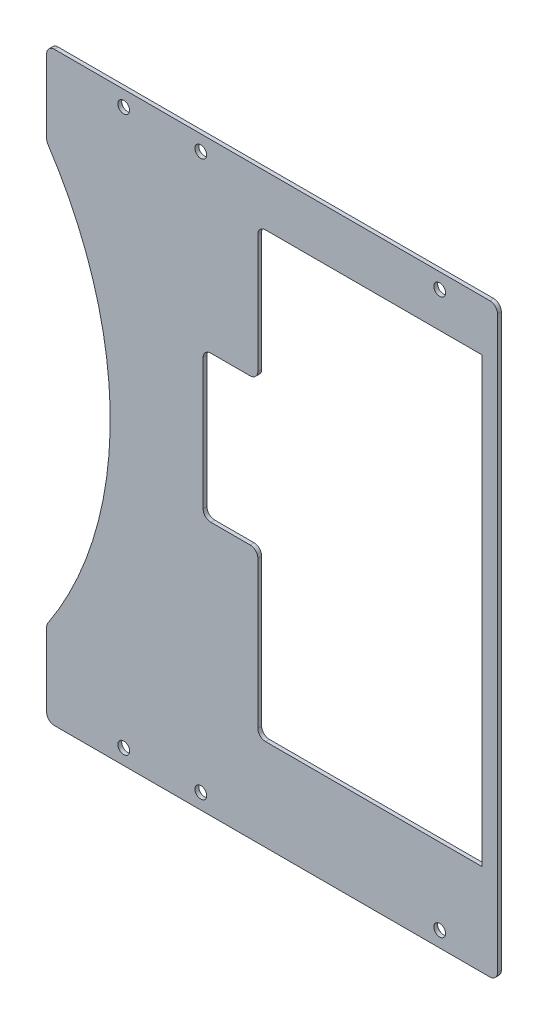
ISO-10303-21;
HEADER;
FILE_DESCRIPTION(('STEP AP214'),'2;1');
FILE_NAME('part.step','',(''),(''),'','','');
FILE_SCHEMA(('AUTOMOTIVE_DESIGN { 1 0 10303 214 1 1 1 1 }'));
ENDSEC;
DATA;
#1=APPLICATION_CONTEXT('core data for automotive mechanical design processes');
#2=APPLICATION_PROTOCOL_DEFINITION('international standard','automotive_design',2000,#1);
#3=PRODUCT_CONTEXT('',#1,'mechanical');
#4=PRODUCT('Part','Part','',(#3));
#5=PRODUCT_RELATED_PRODUCT_CATEGORY('part','',(#4));
#6=PRODUCT_DEFINITION_FORMATION('','',#4);
#7=PRODUCT_DEFINITION_CONTEXT('part definition',#1,'design');
#8=PRODUCT_DEFINITION('design','',#6,#7);
#9=PRODUCT_DEFINITION_SHAPE('','',#8);
#10=(LENGTH_UNIT() NAMED_UNIT(*) SI_UNIT(.MILLI.,.METRE.));
#11=(NAMED_UNIT(*) PLANE_ANGLE_UNIT() SI_UNIT($,.RADIAN.));
#12=(NAMED_UNIT(*) SI_UNIT($,.STERADIAN.) SOLID_ANGLE_UNIT());
#13=UNCERTAINTY_MEASURE_WITH_UNIT(LENGTH_MEASURE(1.E-05),#10,'distance_accuracy_value','');
#14=(GEOMETRIC_REPRESENTATION_CONTEXT(3) GLOBAL_UNCERTAINTY_ASSIGNED_CONTEXT((#13)) GLOBAL_UNIT_ASSIGNED_CONTEXT((#10,
#11,#12)) REPRESENTATION_CONTEXT('',''));
#15=CARTESIAN_POINT('',(0.,0.,0.));
#16=DIRECTION('',(0.,0.,1.));
#17=DIRECTION('',(1.,0.,0.));
#18=AXIS2_PLACEMENT_3D('',#15,#16,#17);
#19=CARTESIAN_POINT('',(34.7980389908,62.8000005715852,10.));
#20=DIRECTION('',(-1.,0.,0.));
#21=DIRECTION('',(0.,-1.,0.));
#22=AXIS2_PLACEMENT_3D('',#19,#20,#21);
#23=PLANE('',#22);
#24=DIRECTION('',(0.,1.,0.));
#25=VECTOR('',#24,1.);
#26=CARTESIAN_POINT('',(34.7980389908,62.8000005715852,0.));
#27=LINE('',#26,#25);
#28=CARTESIAN_POINT('',(34.7980389908,29.9999931858932,0.));
#29=VERTEX_POINT('',#28);
#30=CARTESIAN_POINT('',(34.7980389908,60.8000005715852,0.));
#31=VERTEX_POINT('',#30);
#32=EDGE_CURVE('E251',#29,#31,#27,.T.);
#33=ORIENTED_EDGE('',*,*,#32,.T.);
#34=DIRECTION('',(0.,0.,-1.));
#35=VECTOR('',#34,1.);
#36=CARTESIAN_POINT('',(34.7980389908,60.8000005715852,0.999999999999999));
#37=LINE('',#36,#35);
#38=CARTESIAN_POINT('',(34.7980389908,60.8000005715852,1.));
#39=VERTEX_POINT('',#38);
#40=EDGE_CURVE('E418',#31,#39,#37,.F.);
#41=ORIENTED_EDGE('',*,*,#40,.T.);
#42=DIRECTION('',(0.,-1.,0.));
#43=VECTOR('',#42,1.);
#44=CARTESIAN_POINT('',(34.7980389908,0.,1.));
#45=LINE('',#44,#43);
#46=CARTESIAN_POINT('',(34.7980389908,29.9999931858932,1.));
#47=VERTEX_POINT('',#46);
#48=EDGE_CURVE('E265',#39,#47,#45,.T.);
#49=ORIENTED_EDGE('',*,*,#48,.T.);
#50=DIRECTION('',(0.,0.,-1.));
#51=VECTOR('',#50,1.);
#52=CARTESIAN_POINT('',(34.7980389908,29.9999931858932,10.));
#53=LINE('',#52,#51);
#54=EDGE_CURVE('E415',#47,#29,#53,.T.);
#55=ORIENTED_EDGE('',*,*,#54,.T.);
#56=EDGE_LOOP('',(#33,#41,#49,#55));
#57=FACE_BOUND('',#56,.T.);
#58=ADVANCED_FACE('F35',(#57),#23,.F.);
#59=CARTESIAN_POINT('',(-20.,-76.,1.));
#60=DIRECTION('',(1.,0.,0.));
#61=DIRECTION('',(0.,0.,-1.));
#62=AXIS2_PLACEMENT_3D('',#59,#60,#61);
#63=PLANE('',#62);
#64=DIRECTION('',(0.,-1.,0.));
#65=VECTOR('',#64,1.);
#66=CARTESIAN_POINT('',(-20.,-76.,0.));
#67=LINE('',#66,#65);
#68=CARTESIAN_POINT('',(-20.,-54.8748576307953,0.));
#69=VERTEX_POINT('',#68);
#70=CARTESIAN_POINT('',(-20.,-74.,0.));
#71=VERTEX_POINT('',#70);
#72=EDGE_CURVE('E302',#69,#71,#67,.T.);
#73=ORIENTED_EDGE('',*,*,#72,.T.);
#74=DIRECTION('',(0.,0.,-1.));
#75=VECTOR('',#74,1.);
#76=CARTESIAN_POINT('',(-20.,-74.,1.));
#77=LINE('',#76,#75);
#78=CARTESIAN_POINT('',(-20.,-74.,1.));
#79=VERTEX_POINT('',#78);
#80=EDGE_CURVE('E396',#71,#79,#77,.F.);
#81=ORIENTED_EDGE('',*,*,#80,.T.);
#82=DIRECTION('',(0.,-1.,0.));
#83=VECTOR('',#82,1.);
#84=CARTESIAN_POINT('',(-20.,-76.,1.));
#85=LINE('',#84,#83);
#86=CARTESIAN_POINT('',(-20.,-54.8748576307953,1.));
#87=VERTEX_POINT('',#86);
#88=EDGE_CURVE('E305',#87,#79,#85,.T.);
#89=ORIENTED_EDGE('',*,*,#88,.F.);
#90=DIRECTION('',(0.,0.,-1.));
#91=VECTOR('',#90,1.);
#92=CARTESIAN_POINT('',(-20.,-54.8748576307953,1.));
#93=LINE('',#92,#91);
#94=EDGE_CURVE('E393',#87,#69,#93,.T.);
#95=ORIENTED_EDGE('',*,*,#94,.T.);
#96=EDGE_LOOP('',(#73,#81,#89,#95));
#97=FACE_BOUND('',#96,.T.);
#98=ADVANCED_FACE('F497',(#97),#63,.F.);
#99=CARTESIAN_POINT('',(0.,0.,1.));
#100=DIRECTION('',(0.,0.,1.));
#101=DIRECTION('',(1.,0.,0.));
#102=AXIS2_PLACEMENT_3D('',#99,#100,#101);
#103=PLANE('',#102);
#104=CARTESIAN_POINT('',(95.,-74.,1.));
#105=DIRECTION('',(0.,0.,1.));
#106=DIRECTION('',(1.,0.,0.));
#107=AXIS2_PLACEMENT_3D('',#104,#105,#106);
#108=CIRCLE('',#107,2.);
#109=CARTESIAN_POINT('',(95.,-76.,1.));
#110=VERTEX_POINT('',#109);
#111=CARTESIAN_POINT('',(97.,-74.,1.));
#112=VERTEX_POINT('',#111);
#113=EDGE_CURVE('E362',#110,#112,#108,.T.);
#114=ORIENTED_EDGE('',*,*,#113,.T.);
#115=DIRECTION('',(0.,1.,0.));
#116=VECTOR('',#115,1.);
#117=CARTESIAN_POINT('',(97.,-76.,1.));
#118=LINE('',#117,#116);
#119=CARTESIAN_POINT('',(97.,74.,1.));
#120=VERTEX_POINT('',#119);
#121=EDGE_CURVE('E313',#112,#120,#118,.T.);
#122=ORIENTED_EDGE('',*,*,#121,.T.);
#123=CARTESIAN_POINT('',(95.,74.,1.));
#124=DIRECTION('',(0.,0.,1.));
#125=DIRECTION('',(1.,0.,0.));
#126=AXIS2_PLACEMENT_3D('',#123,#124,#125);
#127=CIRCLE('',#126,2.);
#128=CARTESIAN_POINT('',(95.,76.,1.));
#129=VERTEX_POINT('',#128);
#130=EDGE_CURVE('E350',#120,#129,#127,.T.);
#131=ORIENTED_EDGE('',*,*,#130,.T.);
#132=DIRECTION('',(-1.,0.,0.));
#133=VECTOR('',#132,1.);
#134=CARTESIAN_POINT('',(97.,76.,1.));
#135=LINE('',#134,#133);
#136=CARTESIAN_POINT('',(-18.,76.,1.));
#137=VERTEX_POINT('',#136);
#138=EDGE_CURVE('E316',#129,#137,#135,.T.);
#139=ORIENTED_EDGE('',*,*,#138,.T.);
#140=CARTESIAN_POINT('',(-18.,74.,1.));
#141=DIRECTION('',(0.,0.,1.));
#142=DIRECTION('',(1.,0.,0.));
#143=AXIS2_PLACEMENT_3D('',#140,#141,#142);
#144=CIRCLE('',#143,2.);
#145=CARTESIAN_POINT('',(-20.,74.,1.));
#146=VERTEX_POINT('',#145);
#147=EDGE_CURVE('E354',#137,#146,#144,.T.);
#148=ORIENTED_EDGE('',*,*,#147,.T.);
#149=CARTESIAN_POINT('',(-20.,54.874857630795,1.));
#150=VERTEX_POINT('',#149);
#151=EDGE_CURVE('E308',#146,#150,#85,.T.);
#152=ORIENTED_EDGE('',*,*,#151,.T.);
#153=CARTESIAN_POINT('',(-18.,54.874857630795,0.999999999999999));
#154=DIRECTION('',(0.,0.,1.));
#155=DIRECTION('',(1.,0.,0.));
#156=AXIS2_PLACEMENT_3D('',#153,#154,#155);
#157=CIRCLE('',#156,2.);
#158=CARTESIAN_POINT('',(-19.6683417085427,53.7718454171107,0.999999999999999));
#159=VERTEX_POINT('',#158);
#160=EDGE_CURVE('E356',#150,#159,#157,.T.);
#161=ORIENTED_EDGE('',*,*,#160,.T.);
#162=CARTESIAN_POINT('',(-101.,-1.2490009027033E-13,0.999999999999999));
#163=DIRECTION('',(0.,0.,1.));
#164=DIRECTION('',(1.,0.,0.));
#165=AXIS2_PLACEMENT_3D('',#162,#163,#164);
#166=CIRCLE('',#165,97.5);
#167=CARTESIAN_POINT('',(-19.6683417085427,-53.7718454171109,0.999999999999999));
#168=VERTEX_POINT('',#167);
#169=EDGE_CURVE('E261',#168,#159,#166,.T.);
#170=ORIENTED_EDGE('',*,*,#169,.F.);
#171=CARTESIAN_POINT('',(-18.,-54.8748576307953,0.999999999999999));
#172=DIRECTION('',(0.,0.,1.));
#173=DIRECTION('',(1.,0.,0.));
#174=AXIS2_PLACEMENT_3D('',#171,#172,#173);
#175=CIRCLE('',#174,2.);
#176=EDGE_CURVE('E358',#168,#87,#175,.T.);
#177=ORIENTED_EDGE('',*,*,#176,.T.);
#178=ORIENTED_EDGE('',*,*,#88,.T.);
#179=CARTESIAN_POINT('',(-18.,-74.,1.));
#180=DIRECTION('',(0.,0.,1.));
#181=DIRECTION('',(1.,0.,0.));
#182=AXIS2_PLACEMENT_3D('',#179,#180,#181);
#183=CIRCLE('',#182,2.);
#184=CARTESIAN_POINT('',(-18.,-76.,1.));
#185=VERTEX_POINT('',#184);
#186=EDGE_CURVE('E360',#79,#185,#183,.T.);
#187=ORIENTED_EDGE('',*,*,#186,.T.);
#188=DIRECTION('',(1.,0.,0.));
#189=VECTOR('',#188,1.);
#190=CARTESIAN_POINT('',(97.,-76.,1.));
#191=LINE('',#190,#189);
#192=EDGE_CURVE('E310',#185,#110,#191,.T.);
#193=ORIENTED_EDGE('',*,*,#192,.T.);
#194=EDGE_LOOP('',(#114,#122,#131,#139,#148,#152,#161,#170,#177,#178,#187,#193));
#195=FACE_BOUND('',#194,.T.);
#196=CARTESIAN_POINT('',(34.7980389908,-12.0000000000014,1.));
#197=VERTEX_POINT('',#196);
#198=CARTESIAN_POINT('',(34.7980389908,-50.1999994284148,1.));
#199=VERTEX_POINT('',#198);
#200=EDGE_CURVE('E264',#197,#199,#45,.T.);
#201=ORIENTED_EDGE('',*,*,#200,.F.);
#202=CARTESIAN_POINT('',(32.7980389908,-12.0000000000014,0.999999999999999));
#203=DIRECTION('',(0.,0.,1.));
#204=DIRECTION('',(1.,0.,0.));
#205=AXIS2_PLACEMENT_3D('',#202,#203,#204);
#206=CIRCLE('',#205,2.);
#207=CARTESIAN_POINT('',(32.7980389908,-10.0000000000014,1.));
#208=VERTEX_POINT('',#207);
#209=EDGE_CURVE('E365',#197,#208,#206,.T.);
#210=ORIENTED_EDGE('',*,*,#209,.T.);
#211=DIRECTION('',(1.,0.,0.));
#212=VECTOR('',#211,1.);
#213=CARTESIAN_POINT('',(0.,-10.0000000000014,1.));
#214=LINE('',#213,#212);
#215=CARTESIAN_POINT('',(22.5999999999984,-10.0000000000014,1.));
#216=VERTEX_POINT('',#215);
#217=EDGE_CURVE('E242',#216,#208,#214,.T.);
#218=ORIENTED_EDGE('',*,*,#217,.F.);
#219=CARTESIAN_POINT('',(22.5999999999984,-8.00000000000138,0.999999999999999));
#220=DIRECTION('',(0.,0.,1.));
#221=DIRECTION('',(1.,0.,0.));
#222=AXIS2_PLACEMENT_3D('',#219,#220,#221);
#223=CIRCLE('',#222,2.);
#224=CARTESIAN_POINT('',(20.5999999999984,-8.00000000000138,1.));
#225=VERTEX_POINT('',#224);
#226=EDGE_CURVE('E428',#216,#225,#223,.F.);
#227=ORIENTED_EDGE('',*,*,#226,.T.);
#228=DIRECTION('',(0.,-1.,0.));
#229=VECTOR('',#228,1.);
#230=CARTESIAN_POINT('',(20.5999999999984,0.,1.));
#231=LINE('',#230,#229);
#232=CARTESIAN_POINT('',(20.5999999999984,25.9999931858932,1.));
#233=VERTEX_POINT('',#232);
#234=EDGE_CURVE('E248',#233,#225,#231,.T.);
#235=ORIENTED_EDGE('',*,*,#234,.F.);
#236=CARTESIAN_POINT('',(22.5999999999984,25.9999931858932,0.999999999999999));
#237=DIRECTION('',(0.,0.,1.));
#238=DIRECTION('',(1.,0.,0.));
#239=AXIS2_PLACEMENT_3D('',#236,#237,#238);
#240=CIRCLE('',#239,2.);
#241=CARTESIAN_POINT('',(22.5999999999984,27.9999931858932,1.));
#242=VERTEX_POINT('',#241);
#243=EDGE_CURVE('E424',#233,#242,#240,.F.);
#244=ORIENTED_EDGE('',*,*,#243,.T.);
#245=DIRECTION('',(-1.,0.,0.));
#246=VECTOR('',#245,1.);
#247=CARTESIAN_POINT('',(0.,27.9999931858932,1.));
#248=LINE('',#247,#246);
#249=CARTESIAN_POINT('',(32.7980389908,27.9999931858932,1.));
#250=VERTEX_POINT('',#249);
#251=EDGE_CURVE('E245',#250,#242,#248,.T.);
#252=ORIENTED_EDGE('',*,*,#251,.F.);
#253=CARTESIAN_POINT('',(32.7980389908,29.9999931858932,0.999999999999999));
#254=DIRECTION('',(0.,0.,1.));
#255=DIRECTION('',(1.,0.,0.));
#256=AXIS2_PLACEMENT_3D('',#253,#254,#255);
#257=CIRCLE('',#256,2.);
#258=EDGE_CURVE('E352',#250,#47,#257,.T.);
#259=ORIENTED_EDGE('',*,*,#258,.T.);
#260=ORIENTED_EDGE('',*,*,#48,.F.);
#261=CARTESIAN_POINT('',(36.7980389908,60.8000005715852,0.999999999999999));
#262=DIRECTION('',(0.,0.,1.));
#263=DIRECTION('',(1.,0.,0.));
#264=AXIS2_PLACEMENT_3D('',#261,#262,#263);
#265=CIRCLE('',#264,2.);
#266=CARTESIAN_POINT('',(36.7980389908,62.8000005715852,1.));
#267=VERTEX_POINT('',#266);
#268=EDGE_CURVE('E11',#39,#267,#265,.F.);
#269=ORIENTED_EDGE('',*,*,#268,.T.);
#270=DIRECTION('',(-1.,0.,0.));
#271=VECTOR('',#270,1.);
#272=CARTESIAN_POINT('',(0.,62.8000005715852,1.));
#273=LINE('',#272,#271);
#274=CARTESIAN_POINT('',(93.,62.8000005715852,1.));
#275=VERTEX_POINT('',#274);
#276=EDGE_CURVE('E254',#275,#267,#273,.T.);
#277=ORIENTED_EDGE('',*,*,#276,.F.);
#278=DIRECTION('',(0.,-1.,0.));
#279=VECTOR('',#278,1.);
#280=CARTESIAN_POINT('',(93.,62.8000005715852,1.));
#281=LINE('',#280,#279);
#282=CARTESIAN_POINT('',(93.,-52.1999994284148,1.));
#283=VERTEX_POINT('',#282);
#284=EDGE_CURVE('E226',#275,#283,#281,.T.);
#285=ORIENTED_EDGE('',*,*,#284,.T.);
#286=DIRECTION('',(1.,0.,0.));
#287=VECTOR('',#286,1.);
#288=CARTESIAN_POINT('',(0.,-52.1999994284148,1.));
#289=LINE('',#288,#287);
#290=CARTESIAN_POINT('',(36.7980389908,-52.1999994284148,1.));
#291=VERTEX_POINT('',#290);
#292=EDGE_CURVE('E50',#291,#283,#289,.T.);
#293=ORIENTED_EDGE('',*,*,#292,.F.);
#294=CARTESIAN_POINT('',(36.7980389908,-50.1999994284148,0.999999999999999));
#295=DIRECTION('',(0.,0.,1.));
#296=DIRECTION('',(1.,0.,0.));
#297=AXIS2_PLACEMENT_3D('',#294,#295,#296);
#298=CIRCLE('',#297,2.);
#299=EDGE_CURVE('E431',#291,#199,#298,.F.);
#300=ORIENTED_EDGE('',*,*,#299,.T.);
#301=EDGE_LOOP('',(#201,#210,#218,#227,#235,#244,#252,#259,#260,#269,#277,#285,#293,#300));
#302=FACE_BOUND('',#301,.T.);
#303=CARTESIAN_POINT('',(82.,-72.,1.));
#304=DIRECTION('',(0.,0.,1.));
#305=DIRECTION('',(1.,0.,0.));
#306=AXIS2_PLACEMENT_3D('',#303,#304,#305);
#307=CIRCLE('',#306,1.525);
#308=CARTESIAN_POINT('',(83.525,-72.,1.));
#309=VERTEX_POINT('',#308);
#310=EDGE_CURVE('E275',#309,#309,#307,.T.);
#311=ORIENTED_EDGE('',*,*,#310,.F.);
#312=EDGE_LOOP('',(#311));
#313=FACE_BOUND('',#312,.T.);
#314=CARTESIAN_POINT('',(20.,72.,1.));
#315=DIRECTION('',(0.,0.,1.));
#316=DIRECTION('',(1.,0.,0.));
#317=AXIS2_PLACEMENT_3D('',#314,#315,#316);
#318=CIRCLE('',#317,1.525);
#319=CARTESIAN_POINT('',(21.525,72.,1.));
#320=VERTEX_POINT('',#319);
#321=EDGE_CURVE('E287',#320,#320,#318,.T.);
#322=ORIENTED_EDGE('',*,*,#321,.F.);
#323=EDGE_LOOP('',(#322));
#324=FACE_BOUND('',#323,.T.);
#325=CARTESIAN_POINT('',(0.,72.,1.));
#326=DIRECTION('',(0.,0.,1.));
#327=DIRECTION('',(1.,0.,0.));
#328=AXIS2_PLACEMENT_3D('',#325,#326,#327);
#329=CIRCLE('',#328,1.525);
#330=CARTESIAN_POINT('',(1.525,72.,1.));
#331=VERTEX_POINT('',#330);
#332=EDGE_CURVE('E299',#331,#331,#329,.T.);
#333=ORIENTED_EDGE('',*,*,#332,.F.);
#334=EDGE_LOOP('',(#333));
#335=FACE_BOUND('',#334,.T.);
#336=CARTESIAN_POINT('',(0.,-72.,1.));
#337=DIRECTION('',(0.,0.,1.));
#338=DIRECTION('',(1.,0.,0.));
#339=AXIS2_PLACEMENT_3D('',#336,#337,#338);
#340=CIRCLE('',#339,1.525);
#341=CARTESIAN_POINT('',(1.525,-72.,1.));
#342=VERTEX_POINT('',#341);
#343=EDGE_CURVE('E293',#342,#342,#340,.T.);
#344=ORIENTED_EDGE('',*,*,#343,.F.);
#345=EDGE_LOOP('',(#344));
#346=FACE_BOUND('',#345,.T.);
#347=CARTESIAN_POINT('',(82.,72.,1.));
#348=DIRECTION('',(0.,0.,1.));
#349=DIRECTION('',(1.,0.,0.));
#350=AXIS2_PLACEMENT_3D('',#347,#348,#349);
#351=CIRCLE('',#350,1.525);
#352=CARTESIAN_POINT('',(83.525,72.,1.));
#353=VERTEX_POINT('',#352);
#354=EDGE_CURVE('E281',#353,#353,#351,.T.);
#355=ORIENTED_EDGE('',*,*,#354,.F.);
#356=EDGE_LOOP('',(#355));
#357=FACE_BOUND('',#356,.T.);
#358=CARTESIAN_POINT('',(20.,-72.,1.));
#359=DIRECTION('',(0.,0.,1.));
#360=DIRECTION('',(1.,0.,0.));
#361=AXIS2_PLACEMENT_3D('',#358,#359,#360);
#362=CIRCLE('',#361,1.525);
#363=CARTESIAN_POINT('',(21.525,-72.,1.));
#364=VERTEX_POINT('',#363);
#365=EDGE_CURVE('E269',#364,#364,#362,.T.);
#366=ORIENTED_EDGE('',*,*,#365,.F.);
#367=EDGE_LOOP('',(#366));
#368=FACE_BOUND('',#367,.T.);
#369=ADVANCED_FACE('F444',(#195,#302,#313,#324,#335,#346,#357,#368),#103,.T.);
#370=CARTESIAN_POINT('',(0.,0.,0.));
#371=DIRECTION('',(0.,0.,1.));
#372=DIRECTION('',(1.,0.,0.));
#373=AXIS2_PLACEMENT_3D('',#370,#371,#372);
#374=PLANE('',#373);
#375=DIRECTION('',(-1.,0.,0.));
#376=VECTOR('',#375,1.);
#377=CARTESIAN_POINT('',(97.,-52.1999994284148,0.));
#378=LINE('',#377,#376);
#379=CARTESIAN_POINT('',(93.,-52.1999994284148,0.));
#380=VERTEX_POINT('',#379);
#381=CARTESIAN_POINT('',(36.7980389908,-52.1999994284148,0.));
#382=VERTEX_POINT('',#381);
#383=EDGE_CURVE('E209',#380,#382,#378,.T.);
#384=ORIENTED_EDGE('',*,*,#383,.F.);
#385=DIRECTION('',(0.,1.,0.));
#386=VECTOR('',#385,1.);
#387=CARTESIAN_POINT('',(93.,62.8000005715852,0.));
#388=LINE('',#387,#386);
#389=CARTESIAN_POINT('',(93.,62.8000005715852,0.));
#390=VERTEX_POINT('',#389);
#391=EDGE_CURVE('E213',#380,#390,#388,.T.);
#392=ORIENTED_EDGE('',*,*,#391,.T.);
#393=DIRECTION('',(1.,0.,0.));
#394=VECTOR('',#393,1.);
#395=CARTESIAN_POINT('',(97.,62.8000005715852,0.));
#396=LINE('',#395,#394);
#397=CARTESIAN_POINT('',(36.7980389908,62.8000005715852,0.));
#398=VERTEX_POINT('',#397);
#399=EDGE_CURVE('E58',#398,#390,#396,.T.);
#400=ORIENTED_EDGE('',*,*,#399,.F.);
#401=CARTESIAN_POINT('',(36.7980389908,60.8000005715852,0.));
#402=DIRECTION('',(0.,0.,1.));
#403=DIRECTION('',(1.,0.,0.));
#404=AXIS2_PLACEMENT_3D('',#401,#402,#403);
#405=CIRCLE('',#404,2.);
#406=EDGE_CURVE('E43',#398,#31,#405,.T.);
#407=ORIENTED_EDGE('',*,*,#406,.T.);
#408=ORIENTED_EDGE('',*,*,#32,.F.);
#409=CARTESIAN_POINT('',(32.7980389908,29.9999931858932,0.));
#410=DIRECTION('',(0.,0.,1.));
#411=DIRECTION('',(1.,0.,0.));
#412=AXIS2_PLACEMENT_3D('',#409,#410,#411);
#413=CIRCLE('',#412,2.);
#414=CARTESIAN_POINT('',(32.7980389908,27.9999931858932,0.));
#415=VERTEX_POINT('',#414);
#416=EDGE_CURVE('E369',#29,#415,#413,.F.);
#417=ORIENTED_EDGE('',*,*,#416,.T.);
#418=DIRECTION('',(1.,0.,0.));
#419=VECTOR('',#418,1.);
#420=CARTESIAN_POINT('',(40.5999999999984,27.9999931858932,0.));
#421=LINE('',#420,#419);
#422=CARTESIAN_POINT('',(22.5999999999984,27.9999931858932,0.));
#423=VERTEX_POINT('',#422);
#424=EDGE_CURVE('E239',#423,#415,#421,.T.);
#425=ORIENTED_EDGE('',*,*,#424,.F.);
#426=CARTESIAN_POINT('',(22.5999999999984,25.9999931858932,0.));
#427=DIRECTION('',(0.,0.,1.));
#428=DIRECTION('',(1.,0.,0.));
#429=AXIS2_PLACEMENT_3D('',#426,#427,#428);
#430=CIRCLE('',#429,2.);
#431=CARTESIAN_POINT('',(20.5999999999984,25.9999931858932,0.));
#432=VERTEX_POINT('',#431);
#433=EDGE_CURVE('E422',#423,#432,#430,.T.);
#434=ORIENTED_EDGE('',*,*,#433,.T.);
#435=DIRECTION('',(0.,1.,0.));
#436=VECTOR('',#435,1.);
#437=CARTESIAN_POINT('',(20.5999999999984,27.9999931858932,0.));
#438=LINE('',#437,#436);
#439=CARTESIAN_POINT('',(20.5999999999984,-8.00000000000138,0.));
#440=VERTEX_POINT('',#439);
#441=EDGE_CURVE('E232',#440,#432,#438,.T.);
#442=ORIENTED_EDGE('',*,*,#441,.F.);
#443=CARTESIAN_POINT('',(22.5999999999984,-8.00000000000138,0.));
#444=DIRECTION('',(0.,0.,1.));
#445=DIRECTION('',(1.,0.,0.));
#446=AXIS2_PLACEMENT_3D('',#443,#444,#445);
#447=CIRCLE('',#446,2.);
#448=CARTESIAN_POINT('',(22.5999999999984,-10.0000000000014,0.));
#449=VERTEX_POINT('',#448);
#450=EDGE_CURVE('E426',#440,#449,#447,.T.);
#451=ORIENTED_EDGE('',*,*,#450,.T.);
#452=DIRECTION('',(-1.,0.,0.));
#453=VECTOR('',#452,1.);
#454=CARTESIAN_POINT('',(40.5999999999984,-10.0000000000014,0.));
#455=LINE('',#454,#453);
#456=CARTESIAN_POINT('',(32.7980389908,-10.0000000000014,0.));
#457=VERTEX_POINT('',#456);
#458=EDGE_CURVE('E229',#457,#449,#455,.T.);
#459=ORIENTED_EDGE('',*,*,#458,.F.);
#460=CARTESIAN_POINT('',(32.7980389908,-12.0000000000014,0.));
#461=DIRECTION('',(0.,0.,1.));
#462=DIRECTION('',(1.,0.,0.));
#463=AXIS2_PLACEMENT_3D('',#460,#461,#462);
#464=CIRCLE('',#463,2.);
#465=CARTESIAN_POINT('',(34.7980389908,-12.0000000000014,0.));
#466=VERTEX_POINT('',#465);
#467=EDGE_CURVE('E381',#457,#466,#464,.F.);
#468=ORIENTED_EDGE('',*,*,#467,.T.);
#469=CARTESIAN_POINT('',(34.7980389908,-50.1999994284148,0.));
#470=VERTEX_POINT('',#469);
#471=EDGE_CURVE('E257',#470,#466,#27,.T.);
#472=ORIENTED_EDGE('',*,*,#471,.F.);
#473=CARTESIAN_POINT('',(36.7980389908,-50.1999994284148,0.));
#474=DIRECTION('',(0.,0.,1.));
#475=DIRECTION('',(1.,0.,0.));
#476=AXIS2_PLACEMENT_3D('',#473,#474,#475);
#477=CIRCLE('',#476,2.);
#478=EDGE_CURVE('E216',#470,#382,#477,.T.);
#479=ORIENTED_EDGE('',*,*,#478,.T.);
#480=EDGE_LOOP('',(#384,#392,#400,#407,#408,#417,#425,#434,#442,#451,#459,#468,#472,#479));
#481=FACE_BOUND('',#480,.T.);
#482=DIRECTION('',(0.,1.,0.));
#483=VECTOR('',#482,1.);
#484=CARTESIAN_POINT('',(97.,-76.,0.));
#485=LINE('',#484,#483);
#486=CARTESIAN_POINT('',(97.,-74.,0.));
#487=VERTEX_POINT('',#486);
#488=CARTESIAN_POINT('',(97.,74.,0.));
#489=VERTEX_POINT('',#488);
#490=EDGE_CURVE('E326',#487,#489,#485,.T.);
#491=ORIENTED_EDGE('',*,*,#490,.F.);
#492=CARTESIAN_POINT('',(95.,-74.,0.));
#493=DIRECTION('',(0.,0.,1.));
#494=DIRECTION('',(1.,0.,0.));
#495=AXIS2_PLACEMENT_3D('',#492,#493,#494);
#496=CIRCLE('',#495,2.);
#497=CARTESIAN_POINT('',(95.,-76.,0.));
#498=VERTEX_POINT('',#497);
#499=EDGE_CURVE('E379',#487,#498,#496,.F.);
#500=ORIENTED_EDGE('',*,*,#499,.T.);
#501=DIRECTION('',(1.,0.,0.));
#502=VECTOR('',#501,1.);
#503=CARTESIAN_POINT('',(97.,-76.,0.));
#504=LINE('',#503,#502);
#505=CARTESIAN_POINT('',(-18.,-76.,0.));
#506=VERTEX_POINT('',#505);
#507=EDGE_CURVE('E323',#506,#498,#504,.T.);
#508=ORIENTED_EDGE('',*,*,#507,.F.);
#509=CARTESIAN_POINT('',(-18.,-74.,0.));
#510=DIRECTION('',(0.,0.,1.));
#511=DIRECTION('',(1.,0.,0.));
#512=AXIS2_PLACEMENT_3D('',#509,#510,#511);
#513=CIRCLE('',#512,2.);
#514=EDGE_CURVE('E377',#506,#71,#513,.F.);
#515=ORIENTED_EDGE('',*,*,#514,.T.);
#516=ORIENTED_EDGE('',*,*,#72,.F.);
#517=CARTESIAN_POINT('',(-18.,-54.8748576307953,0.));
#518=DIRECTION('',(0.,0.,1.));
#519=DIRECTION('',(1.,0.,0.));
#520=AXIS2_PLACEMENT_3D('',#517,#518,#519);
#521=CIRCLE('',#520,2.);
#522=CARTESIAN_POINT('',(-19.6683417085427,-53.7718454171109,0.));
#523=VERTEX_POINT('',#522);
#524=EDGE_CURVE('E375',#69,#523,#521,.F.);
#525=ORIENTED_EDGE('',*,*,#524,.T.);
#526=CARTESIAN_POINT('',(-101.,-1.2490009027033E-13,0.));
#527=DIRECTION('',(0.,0.,-1.));
#528=DIRECTION('',(-1.,0.,0.));
#529=AXIS2_PLACEMENT_3D('',#526,#527,#528);
#530=CIRCLE('',#529,97.5);
#531=CARTESIAN_POINT('',(-19.6683417085427,53.7718454171107,0.));
#532=VERTEX_POINT('',#531);
#533=EDGE_CURVE('E218',#532,#523,#530,.T.);
#534=ORIENTED_EDGE('',*,*,#533,.F.);
#535=CARTESIAN_POINT('',(-18.,54.874857630795,0.));
#536=DIRECTION('',(0.,0.,1.));
#537=DIRECTION('',(1.,0.,0.));
#538=AXIS2_PLACEMENT_3D('',#535,#536,#537);
#539=CIRCLE('',#538,2.);
#540=CARTESIAN_POINT('',(-20.,54.874857630795,0.));
#541=VERTEX_POINT('',#540);
#542=EDGE_CURVE('E373',#532,#541,#539,.F.);
#543=ORIENTED_EDGE('',*,*,#542,.T.);
#544=CARTESIAN_POINT('',(-20.,74.,0.));
#545=VERTEX_POINT('',#544);
#546=EDGE_CURVE('E320',#545,#541,#67,.T.);
#547=ORIENTED_EDGE('',*,*,#546,.F.);
#548=CARTESIAN_POINT('',(-18.,74.,0.));
#549=DIRECTION('',(0.,0.,1.));
#550=DIRECTION('',(1.,0.,0.));
#551=AXIS2_PLACEMENT_3D('',#548,#549,#550);
#552=CIRCLE('',#551,2.);
#553=CARTESIAN_POINT('',(-18.,76.,0.));
#554=VERTEX_POINT('',#553);
#555=EDGE_CURVE('E371',#545,#554,#552,.F.);
#556=ORIENTED_EDGE('',*,*,#555,.T.);
#557=DIRECTION('',(-1.,0.,0.));
#558=VECTOR('',#557,1.);
#559=CARTESIAN_POINT('',(97.,76.,0.));
#560=LINE('',#559,#558);
#561=CARTESIAN_POINT('',(95.,76.,0.));
#562=VERTEX_POINT('',#561);
#563=EDGE_CURVE('E309',#562,#554,#560,.T.);
#564=ORIENTED_EDGE('',*,*,#563,.F.);
#565=CARTESIAN_POINT('',(95.,74.,0.));
#566=DIRECTION('',(0.,0.,1.));
#567=DIRECTION('',(1.,0.,0.));
#568=AXIS2_PLACEMENT_3D('',#565,#566,#567);
#569=CIRCLE('',#568,2.);
#570=EDGE_CURVE('E367',#562,#489,#569,.F.);
#571=ORIENTED_EDGE('',*,*,#570,.T.);
#572=EDGE_LOOP('',(#491,#500,#508,#515,#516,#525,#534,#543,#547,#556,#564,#571));
#573=FACE_BOUND('',#572,.T.);
#574=CARTESIAN_POINT('',(0.,72.,0.));
#575=DIRECTION('',(0.,0.,1.));
#576=DIRECTION('',(1.,0.,0.));
#577=AXIS2_PLACEMENT_3D('',#574,#575,#576);
#578=CIRCLE('',#577,1.525);
#579=CARTESIAN_POINT('',(1.525,72.,0.));
#580=VERTEX_POINT('',#579);
#581=EDGE_CURVE('E296',#580,#580,#578,.T.);
#582=ORIENTED_EDGE('',*,*,#581,.T.);
#583=EDGE_LOOP('',(#582));
#584=FACE_BOUND('',#583,.T.);
#585=CARTESIAN_POINT('',(0.,-72.,0.));
#586=DIRECTION('',(0.,0.,1.));
#587=DIRECTION('',(1.,0.,0.));
#588=AXIS2_PLACEMENT_3D('',#585,#586,#587);
#589=CIRCLE('',#588,1.525);
#590=CARTESIAN_POINT('',(1.525,-72.,0.));
#591=VERTEX_POINT('',#590);
#592=EDGE_CURVE('E290',#591,#591,#589,.T.);
#593=ORIENTED_EDGE('',*,*,#592,.T.);
#594=EDGE_LOOP('',(#593));
#595=FACE_BOUND('',#594,.T.);
#596=CARTESIAN_POINT('',(20.,72.,0.));
#597=DIRECTION('',(0.,0.,1.));
#598=DIRECTION('',(1.,0.,0.));
#599=AXIS2_PLACEMENT_3D('',#596,#597,#598);
#600=CIRCLE('',#599,1.525);
#601=CARTESIAN_POINT('',(21.525,72.,0.));
#602=VERTEX_POINT('',#601);
#603=EDGE_CURVE('E284',#602,#602,#600,.T.);
#604=ORIENTED_EDGE('',*,*,#603,.T.);
#605=EDGE_LOOP('',(#604));
#606=FACE_BOUND('',#605,.T.);
#607=CARTESIAN_POINT('',(82.,72.,0.));
#608=DIRECTION('',(0.,0.,1.));
#609=DIRECTION('',(1.,0.,0.));
#610=AXIS2_PLACEMENT_3D('',#607,#608,#609);
#611=CIRCLE('',#610,1.525);
#612=CARTESIAN_POINT('',(83.525,72.,0.));
#613=VERTEX_POINT('',#612);
#614=EDGE_CURVE('E278',#613,#613,#611,.T.);
#615=ORIENTED_EDGE('',*,*,#614,.T.);
#616=EDGE_LOOP('',(#615));
#617=FACE_BOUND('',#616,.T.);
#618=CARTESIAN_POINT('',(82.,-72.,0.));
#619=DIRECTION('',(0.,0.,1.));
#620=DIRECTION('',(1.,0.,0.));
#621=AXIS2_PLACEMENT_3D('',#618,#619,#620);
#622=CIRCLE('',#621,1.525);
#623=CARTESIAN_POINT('',(83.525,-72.,0.));
#624=VERTEX_POINT('',#623);
#625=EDGE_CURVE('E272',#624,#624,#622,.T.);
#626=ORIENTED_EDGE('',*,*,#625,.T.);
#627=EDGE_LOOP('',(#626));
#628=FACE_BOUND('',#627,.T.);
#629=CARTESIAN_POINT('',(20.,-72.,0.));
#630=DIRECTION('',(0.,0.,1.));
#631=DIRECTION('',(1.,0.,0.));
#632=AXIS2_PLACEMENT_3D('',#629,#630,#631);
#633=CIRCLE('',#632,1.525);
#634=CARTESIAN_POINT('',(21.525,-72.,0.));
#635=VERTEX_POINT('',#634);
#636=EDGE_CURVE('E268',#635,#635,#633,.T.);
#637=ORIENTED_EDGE('',*,*,#636,.T.);
#638=EDGE_LOOP('',(#637));
#639=FACE_BOUND('',#638,.T.);
#640=ADVANCED_FACE('F210',(#481,#573,#584,#595,#606,#617,#628,#639),#374,.F.);
#641=ORIENTED_EDGE('',*,*,#546,.T.);
#642=DIRECTION('',(0.,0.,-1.));
#643=VECTOR('',#642,1.);
#644=CARTESIAN_POINT('',(-20.,54.874857630795,1.));
#645=LINE('',#644,#643);
#646=EDGE_CURVE('E405',#541,#150,#645,.F.);
#647=ORIENTED_EDGE('',*,*,#646,.T.);
#648=ORIENTED_EDGE('',*,*,#151,.F.);
#649=DIRECTION('',(0.,0.,-1.));
#650=VECTOR('',#649,1.);
#651=CARTESIAN_POINT('',(-20.,74.,1.));
#652=LINE('',#651,#650);
#653=EDGE_CURVE('E402',#146,#545,#652,.T.);
#654=ORIENTED_EDGE('',*,*,#653,.T.);
#655=EDGE_LOOP('',(#641,#647,#648,#654));
#656=FACE_BOUND('',#655,.T.);
#657=ADVANCED_FACE('F504',(#656),#63,.F.);
#658=CARTESIAN_POINT('',(97.,-76.,1.));
#659=DIRECTION('',(0.,1.,0.));
#660=DIRECTION('',(0.,0.,1.));
#661=AXIS2_PLACEMENT_3D('',#658,#659,#660);
#662=PLANE('',#661);
#663=ORIENTED_EDGE('',*,*,#507,.T.);
#664=DIRECTION('',(0.,0.,-1.));
#665=VECTOR('',#664,1.);
#666=CARTESIAN_POINT('',(95.,-76.,1.));
#667=LINE('',#666,#665);
#668=EDGE_CURVE('E391',#498,#110,#667,.F.);
#669=ORIENTED_EDGE('',*,*,#668,.T.);
#670=ORIENTED_EDGE('',*,*,#192,.F.);
#671=DIRECTION('',(0.,0.,-1.));
#672=VECTOR('',#671,1.);
#673=CARTESIAN_POINT('',(-18.,-76.,1.));
#674=LINE('',#673,#672);
#675=EDGE_CURVE('E388',#185,#506,#674,.T.);
#676=ORIENTED_EDGE('',*,*,#675,.T.);
#677=EDGE_LOOP('',(#663,#669,#670,#676));
#678=FACE_BOUND('',#677,.T.);
#679=ADVANCED_FACE('F552',(#678),#662,.F.);
#680=CARTESIAN_POINT('',(97.,-76.,1.));
#681=DIRECTION('',(-1.,0.,0.));
#682=DIRECTION('',(0.,0.,1.));
#683=AXIS2_PLACEMENT_3D('',#680,#681,#682);
#684=PLANE('',#683);
#685=ORIENTED_EDGE('',*,*,#490,.T.);
#686=DIRECTION('',(0.,0.,-1.));
#687=VECTOR('',#686,1.);
#688=CARTESIAN_POINT('',(97.,74.,1.));
#689=LINE('',#688,#687);
#690=EDGE_CURVE('E420',#489,#120,#689,.F.);
#691=ORIENTED_EDGE('',*,*,#690,.T.);
#692=ORIENTED_EDGE('',*,*,#121,.F.);
#693=DIRECTION('',(0.,0.,-1.));
#694=VECTOR('',#693,1.);
#695=CARTESIAN_POINT('',(97.,-74.,1.));
#696=LINE('',#695,#694);
#697=EDGE_CURVE('E385',#112,#487,#696,.T.);
#698=ORIENTED_EDGE('',*,*,#697,.T.);
#699=EDGE_LOOP('',(#685,#691,#692,#698));
#700=FACE_BOUND('',#699,.T.);
#701=ADVANCED_FACE('F548',(#700),#684,.F.);
#702=CARTESIAN_POINT('',(97.,76.,1.));
#703=DIRECTION('',(0.,-1.,0.));
#704=DIRECTION('',(0.,0.,-1.));
#705=AXIS2_PLACEMENT_3D('',#702,#703,#704);
#706=PLANE('',#705);
#707=ORIENTED_EDGE('',*,*,#563,.T.);
#708=DIRECTION('',(0.,0.,-1.));
#709=VECTOR('',#708,1.);
#710=CARTESIAN_POINT('',(-18.,76.,1.));
#711=LINE('',#710,#709);
#712=EDGE_CURVE('E411',#554,#137,#711,.F.);
#713=ORIENTED_EDGE('',*,*,#712,.T.);
#714=ORIENTED_EDGE('',*,*,#138,.F.);
#715=DIRECTION('',(0.,0.,-1.));
#716=VECTOR('',#715,1.);
#717=CARTESIAN_POINT('',(95.,76.,1.));
#718=LINE('',#717,#716);
#719=EDGE_CURVE('E408',#129,#562,#718,.T.);
#720=ORIENTED_EDGE('',*,*,#719,.T.);
#721=EDGE_LOOP('',(#707,#713,#714,#720));
#722=FACE_BOUND('',#721,.T.);
#723=ADVANCED_FACE('F539',(#722),#706,.F.);
#724=CARTESIAN_POINT('',(0.,72.,1.));
#725=DIRECTION('',(0.,0.,-1.));
#726=DIRECTION('',(-1.,0.,0.));
#727=AXIS2_PLACEMENT_3D('',#724,#725,#726);
#728=CYLINDRICAL_SURFACE('',#727,1.525);
#729=ORIENTED_EDGE('',*,*,#332,.T.);
#730=EDGE_LOOP('',(#729));
#731=FACE_BOUND('',#730,.T.);
#732=ORIENTED_EDGE('',*,*,#581,.F.);
#733=EDGE_LOOP('',(#732));
#734=FACE_BOUND('',#733,.T.);
#735=ADVANCED_FACE('F535',(#731,#734),#728,.F.);
#736=CARTESIAN_POINT('',(0.,-72.,1.));
#737=DIRECTION('',(0.,0.,-1.));
#738=DIRECTION('',(-1.,0.,0.));
#739=AXIS2_PLACEMENT_3D('',#736,#737,#738);
#740=CYLINDRICAL_SURFACE('',#739,1.525);
#741=ORIENTED_EDGE('',*,*,#343,.T.);
#742=EDGE_LOOP('',(#741));
#743=FACE_BOUND('',#742,.T.);
#744=ORIENTED_EDGE('',*,*,#592,.F.);
#745=EDGE_LOOP('',(#744));
#746=FACE_BOUND('',#745,.T.);
#747=ADVANCED_FACE('F531',(#743,#746),#740,.F.);
#748=CARTESIAN_POINT('',(20.,72.,1.));
#749=DIRECTION('',(0.,0.,-1.));
#750=DIRECTION('',(-1.,0.,0.));
#751=AXIS2_PLACEMENT_3D('',#748,#749,#750);
#752=CYLINDRICAL_SURFACE('',#751,1.525);
#753=ORIENTED_EDGE('',*,*,#321,.T.);
#754=EDGE_LOOP('',(#753));
#755=FACE_BOUND('',#754,.T.);
#756=ORIENTED_EDGE('',*,*,#603,.F.);
#757=EDGE_LOOP('',(#756));
#758=FACE_BOUND('',#757,.T.);
#759=ADVANCED_FACE('F527',(#755,#758),#752,.F.);
#760=CARTESIAN_POINT('',(82.,72.,1.));
#761=DIRECTION('',(0.,0.,-1.));
#762=DIRECTION('',(-1.,0.,0.));
#763=AXIS2_PLACEMENT_3D('',#760,#761,#762);
#764=CYLINDRICAL_SURFACE('',#763,1.525);
#765=ORIENTED_EDGE('',*,*,#354,.T.);
#766=EDGE_LOOP('',(#765));
#767=FACE_BOUND('',#766,.T.);
#768=ORIENTED_EDGE('',*,*,#614,.F.);
#769=EDGE_LOOP('',(#768));
#770=FACE_BOUND('',#769,.T.);
#771=ADVANCED_FACE('F520',(#767,#770),#764,.F.);
#772=CARTESIAN_POINT('',(82.,-72.,1.));
#773=DIRECTION('',(0.,0.,-1.));
#774=DIRECTION('',(-1.,0.,0.));
#775=AXIS2_PLACEMENT_3D('',#772,#773,#774);
#776=CYLINDRICAL_SURFACE('',#775,1.525);
#777=ORIENTED_EDGE('',*,*,#310,.T.);
#778=EDGE_LOOP('',(#777));
#779=FACE_BOUND('',#778,.T.);
#780=ORIENTED_EDGE('',*,*,#625,.F.);
#781=EDGE_LOOP('',(#780));
#782=FACE_BOUND('',#781,.T.);
#783=ADVANCED_FACE('F515',(#779,#782),#776,.F.);
#784=CARTESIAN_POINT('',(20.,-72.,1.));
#785=DIRECTION('',(0.,0.,-1.));
#786=DIRECTION('',(-1.,0.,0.));
#787=AXIS2_PLACEMENT_3D('',#784,#785,#786);
#788=CYLINDRICAL_SURFACE('',#787,1.525);
#789=ORIENTED_EDGE('',*,*,#365,.T.);
#790=EDGE_LOOP('',(#789));
#791=FACE_BOUND('',#790,.T.);
#792=ORIENTED_EDGE('',*,*,#636,.F.);
#793=EDGE_LOOP('',(#792));
#794=FACE_BOUND('',#793,.T.);
#795=ADVANCED_FACE('F508',(#791,#794),#788,.F.);
#796=ORIENTED_EDGE('',*,*,#471,.T.);
#797=DIRECTION('',(0.,0.,1.));
#798=VECTOR('',#797,1.);
#799=CARTESIAN_POINT('',(34.7980389908,-12.0000000000014,10.));
#800=LINE('',#799,#798);
#801=EDGE_CURVE('E347',#466,#197,#800,.T.);
#802=ORIENTED_EDGE('',*,*,#801,.T.);
#803=ORIENTED_EDGE('',*,*,#200,.T.);
#804=DIRECTION('',(0.,0.,-1.));
#805=VECTOR('',#804,1.);
#806=CARTESIAN_POINT('',(34.7980389908,-50.1999994284148,0.));
#807=LINE('',#806,#805);
#808=EDGE_CURVE('E344',#199,#470,#807,.T.);
#809=ORIENTED_EDGE('',*,*,#808,.T.);
#810=EDGE_LOOP('',(#796,#802,#803,#809));
#811=FACE_BOUND('',#810,.T.);
#812=ADVANCED_FACE('F479',(#811),#23,.F.);
#813=CARTESIAN_POINT('',(97.,-52.1999994284148,10.));
#814=DIRECTION('',(0.,-1.,0.));
#815=DIRECTION('',(0.,0.,-1.));
#816=AXIS2_PLACEMENT_3D('',#813,#814,#815);
#817=PLANE('',#816);
#818=ORIENTED_EDGE('',*,*,#292,.T.);
#819=DIRECTION('',(0.,0.,1.));
#820=VECTOR('',#819,1.);
#821=CARTESIAN_POINT('',(93.,-52.1999994284148,-115.06954418959));
#822=LINE('',#821,#820);
#823=EDGE_CURVE('E220',#380,#283,#822,.T.);
#824=ORIENTED_EDGE('',*,*,#823,.F.);
#825=ORIENTED_EDGE('',*,*,#383,.T.);
#826=DIRECTION('',(0.,0.,-1.));
#827=VECTOR('',#826,1.);
#828=CARTESIAN_POINT('',(36.7980389908,-52.1999994284148,0.999999999999999));
#829=LINE('',#828,#827);
#830=EDGE_CURVE('E383',#382,#291,#829,.F.);
#831=ORIENTED_EDGE('',*,*,#830,.T.);
#832=EDGE_LOOP('',(#818,#824,#825,#831));
#833=FACE_BOUND('',#832,.T.);
#834=ADVANCED_FACE('F221',(#833),#817,.F.);
#835=CARTESIAN_POINT('',(97.,62.8000005715852,10.));
#836=DIRECTION('',(0.,1.,0.));
#837=DIRECTION('',(0.,0.,1.));
#838=AXIS2_PLACEMENT_3D('',#835,#836,#837);
#839=PLANE('',#838);
#840=ORIENTED_EDGE('',*,*,#399,.T.);
#841=DIRECTION('',(0.,0.,1.));
#842=VECTOR('',#841,1.);
#843=CARTESIAN_POINT('',(93.,62.8000005715852,-115.06954418959));
#844=LINE('',#843,#842);
#845=EDGE_CURVE('E225',#390,#275,#844,.T.);
#846=ORIENTED_EDGE('',*,*,#845,.T.);
#847=ORIENTED_EDGE('',*,*,#276,.T.);
#848=DIRECTION('',(0.,0.,-1.));
#849=VECTOR('',#848,1.);
#850=CARTESIAN_POINT('',(36.7980389908,62.8000005715852,0.));
#851=LINE('',#850,#849);
#852=EDGE_CURVE('E413',#267,#398,#851,.T.);
#853=ORIENTED_EDGE('',*,*,#852,.T.);
#854=EDGE_LOOP('',(#840,#846,#847,#853));
#855=FACE_BOUND('',#854,.T.);
#856=ADVANCED_FACE('F513',(#855),#839,.F.);
#857=CARTESIAN_POINT('',(-101.,-1.2490009027033E-13,10.));
#858=DIRECTION('',(0.,0.,-1.));
#859=DIRECTION('',(-1.,0.,0.));
#860=AXIS2_PLACEMENT_3D('',#857,#858,#859);
#861=CYLINDRICAL_SURFACE('',#860,97.5);
#862=ORIENTED_EDGE('',*,*,#533,.T.);
#863=DIRECTION('',(0.,0.,-1.));
#864=VECTOR('',#863,1.);
#865=CARTESIAN_POINT('',(-19.6683417085427,-53.771845417111,10.));
#866=LINE('',#865,#864);
#867=EDGE_CURVE('E400',#523,#168,#866,.F.);
#868=ORIENTED_EDGE('',*,*,#867,.T.);
#869=ORIENTED_EDGE('',*,*,#169,.T.);
#870=DIRECTION('',(0.,0.,-1.));
#871=VECTOR('',#870,1.);
#872=CARTESIAN_POINT('',(-19.6683417085427,53.7718454171107,10.));
#873=LINE('',#872,#871);
#874=EDGE_CURVE('E398',#159,#532,#873,.T.);
#875=ORIENTED_EDGE('',*,*,#874,.T.);
#876=EDGE_LOOP('',(#862,#868,#869,#875));
#877=FACE_BOUND('',#876,.T.);
#878=ADVANCED_FACE('F682',(#877),#861,.F.);
#879=CARTESIAN_POINT('',(40.5999999999984,27.9999931858932,10.));
#880=DIRECTION('',(0.,1.,0.));
#881=DIRECTION('',(0.,0.,1.));
#882=AXIS2_PLACEMENT_3D('',#879,#880,#881);
#883=PLANE('',#882);
#884=ORIENTED_EDGE('',*,*,#251,.T.);
#885=DIRECTION('',(0.,0.,-1.));
#886=VECTOR('',#885,1.);
#887=CARTESIAN_POINT('',(22.5999999999984,27.9999931858932,0.));
#888=LINE('',#887,#886);
#889=EDGE_CURVE('E332',#242,#423,#888,.T.);
#890=ORIENTED_EDGE('',*,*,#889,.T.);
#891=ORIENTED_EDGE('',*,*,#424,.T.);
#892=DIRECTION('',(0.,0.,-1.));
#893=VECTOR('',#892,1.);
#894=CARTESIAN_POINT('',(32.7980389908,27.9999931858932,10.));
#895=LINE('',#894,#893);
#896=EDGE_CURVE('E319',#415,#250,#895,.F.);
#897=ORIENTED_EDGE('',*,*,#896,.T.);
#898=EDGE_LOOP('',(#884,#890,#891,#897));
#899=FACE_BOUND('',#898,.T.);
#900=ADVANCED_FACE('F453',(#899),#883,.F.);
#901=CARTESIAN_POINT('',(20.5999999999984,27.9999931858932,10.));
#902=DIRECTION('',(-1.,0.,0.));
#903=DIRECTION('',(0.,-1.,0.));
#904=AXIS2_PLACEMENT_3D('',#901,#902,#903);
#905=PLANE('',#904);
#906=ORIENTED_EDGE('',*,*,#441,.T.);
#907=DIRECTION('',(0.,0.,-1.));
#908=VECTOR('',#907,1.);
#909=CARTESIAN_POINT('',(20.5999999999984,25.9999931858932,0.999999999999999));
#910=LINE('',#909,#908);
#911=EDGE_CURVE('E338',#432,#233,#910,.F.);
#912=ORIENTED_EDGE('',*,*,#911,.T.);
#913=ORIENTED_EDGE('',*,*,#234,.T.);
#914=DIRECTION('',(0.,0.,-1.));
#915=VECTOR('',#914,1.);
#916=CARTESIAN_POINT('',(20.5999999999984,-8.00000000000138,0.));
#917=LINE('',#916,#915);
#918=EDGE_CURVE('E335',#225,#440,#917,.T.);
#919=ORIENTED_EDGE('',*,*,#918,.T.);
#920=EDGE_LOOP('',(#906,#912,#913,#919));
#921=FACE_BOUND('',#920,.T.);
#922=ADVANCED_FACE('F461',(#921),#905,.F.);
#923=CARTESIAN_POINT('',(40.5999999999984,-10.0000000000014,10.));
#924=DIRECTION('',(0.,-1.,0.));
#925=DIRECTION('',(0.,0.,-1.));
#926=AXIS2_PLACEMENT_3D('',#923,#924,#925);
#927=PLANE('',#926);
#928=ORIENTED_EDGE('',*,*,#458,.T.);
#929=DIRECTION('',(0.,0.,-1.));
#930=VECTOR('',#929,1.);
#931=CARTESIAN_POINT('',(22.5999999999984,-10.0000000000014,0.999999999999999));
#932=LINE('',#931,#930);
#933=EDGE_CURVE('E342',#449,#216,#932,.F.);
#934=ORIENTED_EDGE('',*,*,#933,.T.);
#935=ORIENTED_EDGE('',*,*,#217,.T.);
#936=DIRECTION('',(0.,0.,1.));
#937=VECTOR('',#936,1.);
#938=CARTESIAN_POINT('',(32.7980389908,-10.0000000000014,10.));
#939=LINE('',#938,#937);
#940=EDGE_CURVE('E340',#208,#457,#939,.F.);
#941=ORIENTED_EDGE('',*,*,#940,.T.);
#942=EDGE_LOOP('',(#928,#934,#935,#941));
#943=FACE_BOUND('',#942,.T.);
#944=ADVANCED_FACE('F471',(#943),#927,.F.);
#945=CARTESIAN_POINT('',(22.5999999999984,25.9999931858932,10.));
#946=DIRECTION('',(0.,0.,1.));
#947=DIRECTION('',(1.,0.,0.));
#948=AXIS2_PLACEMENT_3D('',#945,#946,#947);
#949=CYLINDRICAL_SURFACE('',#948,2.);
#950=ORIENTED_EDGE('',*,*,#243,.F.);
#951=ORIENTED_EDGE('',*,*,#911,.F.);
#952=ORIENTED_EDGE('',*,*,#433,.F.);
#953=ORIENTED_EDGE('',*,*,#889,.F.);
#954=EDGE_LOOP('',(#950,#951,#952,#953));
#955=FACE_BOUND('',#954,.T.);
#956=ADVANCED_FACE('F457',(#955),#949,.F.);
#957=CARTESIAN_POINT('',(22.5999999999984,-8.00000000000138,10.));
#958=DIRECTION('',(0.,0.,1.));
#959=DIRECTION('',(1.,0.,0.));
#960=AXIS2_PLACEMENT_3D('',#957,#958,#959);
#961=CYLINDRICAL_SURFACE('',#960,2.);
#962=ORIENTED_EDGE('',*,*,#226,.F.);
#963=ORIENTED_EDGE('',*,*,#933,.F.);
#964=ORIENTED_EDGE('',*,*,#450,.F.);
#965=ORIENTED_EDGE('',*,*,#918,.F.);
#966=EDGE_LOOP('',(#962,#963,#964,#965));
#967=FACE_BOUND('',#966,.T.);
#968=ADVANCED_FACE('F466',(#967),#961,.F.);
#969=CARTESIAN_POINT('',(32.7980389908,-12.0000000000014,10.));
#970=DIRECTION('',(0.,0.,1.));
#971=DIRECTION('',(1.,0.,0.));
#972=AXIS2_PLACEMENT_3D('',#969,#970,#971);
#973=CYLINDRICAL_SURFACE('',#972,2.);
#974=ORIENTED_EDGE('',*,*,#467,.F.);
#975=ORIENTED_EDGE('',*,*,#940,.F.);
#976=ORIENTED_EDGE('',*,*,#209,.F.);
#977=ORIENTED_EDGE('',*,*,#801,.F.);
#978=EDGE_LOOP('',(#974,#975,#976,#977));
#979=FACE_BOUND('',#978,.T.);
#980=ADVANCED_FACE('F475',(#979),#973,.T.);
#981=CARTESIAN_POINT('',(36.7980389908,-50.1999994284148,10.));
#982=DIRECTION('',(0.,0.,1.));
#983=DIRECTION('',(1.,0.,0.));
#984=AXIS2_PLACEMENT_3D('',#981,#982,#983);
#985=CYLINDRICAL_SURFACE('',#984,2.);
#986=ORIENTED_EDGE('',*,*,#299,.F.);
#987=ORIENTED_EDGE('',*,*,#830,.F.);
#988=ORIENTED_EDGE('',*,*,#478,.F.);
#989=ORIENTED_EDGE('',*,*,#808,.F.);
#990=EDGE_LOOP('',(#986,#987,#988,#989));
#991=FACE_BOUND('',#990,.T.);
#992=ADVANCED_FACE('F484',(#991),#985,.F.);
#993=CARTESIAN_POINT('',(95.,-74.,1.));
#994=DIRECTION('',(0.,0.,-1.));
#995=DIRECTION('',(-1.,0.,0.));
#996=AXIS2_PLACEMENT_3D('',#993,#994,#995);
#997=CYLINDRICAL_SURFACE('',#996,2.);
#998=ORIENTED_EDGE('',*,*,#113,.F.);
#999=ORIENTED_EDGE('',*,*,#668,.F.);
#1000=ORIENTED_EDGE('',*,*,#499,.F.);
#1001=ORIENTED_EDGE('',*,*,#697,.F.);
#1002=EDGE_LOOP('',(#998,#999,#1000,#1001));
#1003=FACE_BOUND('',#1002,.T.);
#1004=ADVANCED_FACE('F486',(#1003),#997,.T.);
#1005=CARTESIAN_POINT('',(-18.,-74.,1.));
#1006=DIRECTION('',(0.,0.,-1.));
#1007=DIRECTION('',(-1.,0.,0.));
#1008=AXIS2_PLACEMENT_3D('',#1005,#1006,#1007);
#1009=CYLINDRICAL_SURFACE('',#1008,2.);
#1010=ORIENTED_EDGE('',*,*,#186,.F.);
#1011=ORIENTED_EDGE('',*,*,#80,.F.);
#1012=ORIENTED_EDGE('',*,*,#514,.F.);
#1013=ORIENTED_EDGE('',*,*,#675,.F.);
#1014=EDGE_LOOP('',(#1010,#1011,#1012,#1013));
#1015=FACE_BOUND('',#1014,.T.);
#1016=ADVANCED_FACE('F492',(#1015),#1009,.T.);
#1017=CARTESIAN_POINT('',(-18.,-54.8748576307953,10.));
#1018=DIRECTION('',(0.,0.,-1.));
#1019=DIRECTION('',(-1.,0.,0.));
#1020=AXIS2_PLACEMENT_3D('',#1017,#1018,#1019);
#1021=CYLINDRICAL_SURFACE('',#1020,2.);
#1022=ORIENTED_EDGE('',*,*,#176,.F.);
#1023=ORIENTED_EDGE('',*,*,#867,.F.);
#1024=ORIENTED_EDGE('',*,*,#524,.F.);
#1025=ORIENTED_EDGE('',*,*,#94,.F.);
#1026=EDGE_LOOP('',(#1022,#1023,#1024,#1025));
#1027=FACE_BOUND('',#1026,.T.);
#1028=ADVANCED_FACE('F590',(#1027),#1021,.T.);
#1029=CARTESIAN_POINT('',(-18.,54.874857630795,10.));
#1030=DIRECTION('',(0.,0.,-1.));
#1031=DIRECTION('',(-1.,0.,0.));
#1032=AXIS2_PLACEMENT_3D('',#1029,#1030,#1031);
#1033=CYLINDRICAL_SURFACE('',#1032,2.);
#1034=ORIENTED_EDGE('',*,*,#542,.F.);
#1035=ORIENTED_EDGE('',*,*,#874,.F.);
#1036=ORIENTED_EDGE('',*,*,#160,.F.);
#1037=ORIENTED_EDGE('',*,*,#646,.F.);
#1038=EDGE_LOOP('',(#1034,#1035,#1036,#1037));
#1039=FACE_BOUND('',#1038,.T.);
#1040=ADVANCED_FACE('F600',(#1039),#1033,.T.);
#1041=CARTESIAN_POINT('',(-18.,74.,1.));
#1042=DIRECTION('',(0.,0.,-1.));
#1043=DIRECTION('',(-1.,0.,0.));
#1044=AXIS2_PLACEMENT_3D('',#1041,#1042,#1043);
#1045=CYLINDRICAL_SURFACE('',#1044,2.);
#1046=ORIENTED_EDGE('',*,*,#147,.F.);
#1047=ORIENTED_EDGE('',*,*,#712,.F.);
#1048=ORIENTED_EDGE('',*,*,#555,.F.);
#1049=ORIENTED_EDGE('',*,*,#653,.F.);
#1050=EDGE_LOOP('',(#1046,#1047,#1048,#1049));
#1051=FACE_BOUND('',#1050,.T.);
#1052=ADVANCED_FACE('F610',(#1051),#1045,.T.);
#1053=CARTESIAN_POINT('',(36.7980389908,60.8000005715852,10.));
#1054=DIRECTION('',(0.,0.,1.));
#1055=DIRECTION('',(1.,0.,0.));
#1056=AXIS2_PLACEMENT_3D('',#1053,#1054,#1055);
#1057=CYLINDRICAL_SURFACE('',#1056,2.);
#1058=ORIENTED_EDGE('',*,*,#268,.F.);
#1059=ORIENTED_EDGE('',*,*,#40,.F.);
#1060=ORIENTED_EDGE('',*,*,#406,.F.);
#1061=ORIENTED_EDGE('',*,*,#852,.F.);
#1062=EDGE_LOOP('',(#1058,#1059,#1060,#1061));
#1063=FACE_BOUND('',#1062,.T.);
#1064=ADVANCED_FACE('F440',(#1063),#1057,.F.);
#1065=CARTESIAN_POINT('',(32.7980389908,29.9999931858932,10.));
#1066=DIRECTION('',(0.,0.,-1.));
#1067=DIRECTION('',(-1.,0.,0.));
#1068=AXIS2_PLACEMENT_3D('',#1065,#1066,#1067);
#1069=CYLINDRICAL_SURFACE('',#1068,2.);
#1070=ORIENTED_EDGE('',*,*,#258,.F.);
#1071=ORIENTED_EDGE('',*,*,#896,.F.);
#1072=ORIENTED_EDGE('',*,*,#416,.F.);
#1073=ORIENTED_EDGE('',*,*,#54,.F.);
#1074=EDGE_LOOP('',(#1070,#1071,#1072,#1073));
#1075=FACE_BOUND('',#1074,.T.);
#1076=ADVANCED_FACE('F449',(#1075),#1069,.T.);
#1077=CARTESIAN_POINT('',(95.,74.,1.));
#1078=DIRECTION('',(0.,0.,-1.));
#1079=DIRECTION('',(-1.,0.,0.));
#1080=AXIS2_PLACEMENT_3D('',#1077,#1078,#1079);
#1081=CYLINDRICAL_SURFACE('',#1080,2.);
#1082=ORIENTED_EDGE('',*,*,#130,.F.);
#1083=ORIENTED_EDGE('',*,*,#690,.F.);
#1084=ORIENTED_EDGE('',*,*,#570,.F.);
#1085=ORIENTED_EDGE('',*,*,#719,.F.);
#1086=EDGE_LOOP('',(#1082,#1083,#1084,#1085));
#1087=FACE_BOUND('',#1086,.T.);
#1088=ADVANCED_FACE('F37',(#1087),#1081,.T.);
#1089=CARTESIAN_POINT('',(93.,62.8000005715852,-115.06954418959));
#1090=DIRECTION('',(-1.,0.,0.));
#1091=DIRECTION('',(0.,-1.,0.));
#1092=AXIS2_PLACEMENT_3D('',#1089,#1090,#1091);
#1093=PLANE('',#1092);
#1094=ORIENTED_EDGE('',*,*,#391,.F.);
#1095=ORIENTED_EDGE('',*,*,#823,.T.);
#1096=ORIENTED_EDGE('',*,*,#284,.F.);
#1097=ORIENTED_EDGE('',*,*,#845,.F.);
#1098=EDGE_LOOP('',(#1094,#1095,#1096,#1097));
#1099=FACE_BOUND('',#1098,.T.);
#1100=ADVANCED_FACE('F228',(#1099),#1093,.T.);
#1101=CLOSED_SHELL('',(#58,#98,#369,#640,#657,#679,#701,#723,#735,#747,#759,#771,#783,#795,#812,
#834,#856,#878,#900,#922,#944,#956,#968,#980,#992,#1004,#1016,#1028,#1040,#1052,#1064,#1076,
#1088,#1100));
#1102=MANIFOLD_SOLID_BREP('B2',#1101);
#1103=ADVANCED_BREP_SHAPE_REPRESENTATION('',(#18,#1102),#14);
#1104=SHAPE_DEFINITION_REPRESENTATION(#9,#1103);
ENDSEC;
END-ISO-10303-21;
